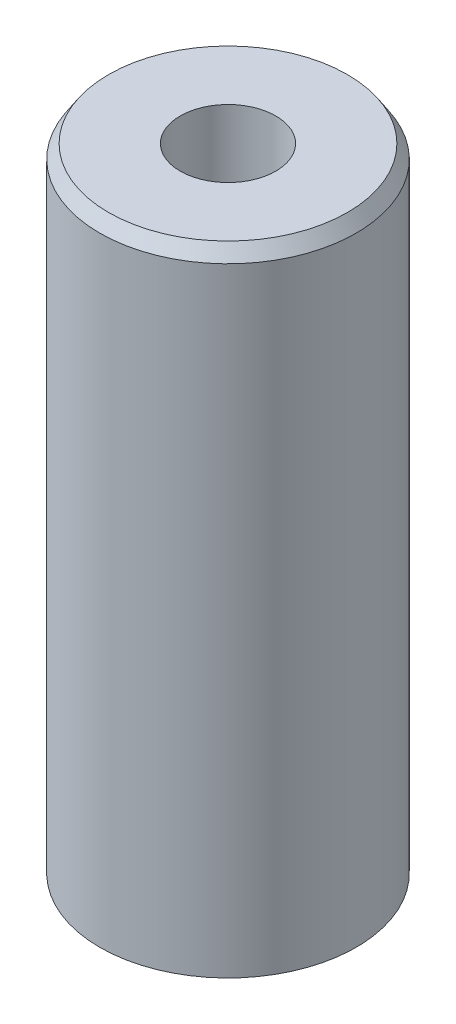
ISO-10303-21;
HEADER;
FILE_DESCRIPTION(('STEP AP214'),'2;1');
FILE_NAME('part.step','',(''),(''),'','','');
FILE_SCHEMA(('AUTOMOTIVE_DESIGN { 1 0 10303 214 1 1 1 1 }'));
ENDSEC;
DATA;
#1=APPLICATION_CONTEXT('core data for automotive mechanical design processes');
#2=APPLICATION_PROTOCOL_DEFINITION('international standard','automotive_design',2000,#1);
#3=PRODUCT_CONTEXT('',#1,'mechanical');
#4=PRODUCT('Part','Part','',(#3));
#5=PRODUCT_RELATED_PRODUCT_CATEGORY('part','',(#4));
#6=PRODUCT_DEFINITION_FORMATION('','',#4);
#7=PRODUCT_DEFINITION_CONTEXT('part definition',#1,'design');
#8=PRODUCT_DEFINITION('design','',#6,#7);
#9=PRODUCT_DEFINITION_SHAPE('','',#8);
#10=(LENGTH_UNIT() NAMED_UNIT(*) SI_UNIT(.MILLI.,.METRE.));
#11=(NAMED_UNIT(*) PLANE_ANGLE_UNIT() SI_UNIT($,.RADIAN.));
#12=(NAMED_UNIT(*) SI_UNIT($,.STERADIAN.) SOLID_ANGLE_UNIT());
#13=UNCERTAINTY_MEASURE_WITH_UNIT(LENGTH_MEASURE(1.E-05),#10,'distance_accuracy_value','');
#14=(GEOMETRIC_REPRESENTATION_CONTEXT(3) GLOBAL_UNCERTAINTY_ASSIGNED_CONTEXT((#13)) GLOBAL_UNIT_ASSIGNED_CONTEXT((#10,
#11,#12)) REPRESENTATION_CONTEXT('',''));
#15=CARTESIAN_POINT('',(0.,0.,0.));
#16=DIRECTION('',(0.,0.,1.));
#17=DIRECTION('',(1.,0.,0.));
#18=AXIS2_PLACEMENT_3D('',#15,#16,#17);
#19=CARTESIAN_POINT('',(0.,49.9819807801235,0.));
#20=DIRECTION('',(0.,-1.,0.));
#21=DIRECTION('',(0.,0.,-1.));
#22=AXIS2_PLACEMENT_3D('',#19,#20,#21);
#23=CYLINDRICAL_SURFACE('',#22,10.);
#24=CARTESIAN_POINT('',(0.,48.9270818391144,0.));
#25=DIRECTION('',(0.,1.,0.));
#26=DIRECTION('',(0.,0.,1.));
#27=AXIS2_PLACEMENT_3D('',#24,#25,#26);
#28=CIRCLE('',#27,10.);
#29=CARTESIAN_POINT('',(0.,48.9270818391144,10.));
#30=VERTEX_POINT('',#29);
#31=EDGE_CURVE('E50',#30,#30,#28,.F.);
#32=ORIENTED_EDGE('',*,*,#31,.T.);
#33=EDGE_LOOP('',(#32));
#34=FACE_BOUND('',#33,.T.);
#35=CARTESIAN_POINT('',(0.,0.68275635539175,0.));
#36=DIRECTION('',(0.,1.,0.));
#37=DIRECTION('',(0.,0.,1.));
#38=AXIS2_PLACEMENT_3D('',#35,#36,#37);
#39=CIRCLE('',#38,10.);
#40=CARTESIAN_POINT('',(0.,0.68275635539175,10.));
#41=VERTEX_POINT('',#40);
#42=EDGE_CURVE('E51',#41,#41,#39,.T.);
#43=ORIENTED_EDGE('',*,*,#42,.T.);
#44=EDGE_LOOP('',(#43));
#45=FACE_BOUND('',#44,.T.);
#46=ADVANCED_FACE('F39',(#34,#45),#23,.T.);
#47=CARTESIAN_POINT('',(0.,49.9819807801235,0.));
#48=DIRECTION('',(0.,1.,0.));
#49=DIRECTION('',(0.,0.,1.));
#50=AXIS2_PLACEMENT_3D('',#47,#48,#49);
#51=PLANE('',#50);
#52=CARTESIAN_POINT('',(0.,49.9819807801235,0.));
#53=DIRECTION('',(0.,1.,0.));
#54=DIRECTION('',(0.,0.,1.));
#55=AXIS2_PLACEMENT_3D('',#52,#53,#54);
#56=CIRCLE('',#55,9.31724364460826);
#57=CARTESIAN_POINT('',(0.,49.9819807801235,9.31724364460826));
#58=VERTEX_POINT('',#57);
#59=EDGE_CURVE('E54',#58,#58,#56,.T.);
#60=ORIENTED_EDGE('',*,*,#59,.T.);
#61=EDGE_LOOP('',(#60));
#62=FACE_BOUND('',#61,.T.);
#63=CARTESIAN_POINT('',(0.,49.9819807801235,0.));
#64=DIRECTION('',(0.,1.,0.));
#65=DIRECTION('',(0.,0.,1.));
#66=AXIS2_PLACEMENT_3D('',#63,#64,#65);
#67=CIRCLE('',#66,3.73097991146228);
#68=CARTESIAN_POINT('',(0.,49.9819807801235,3.73097991146228));
#69=VERTEX_POINT('',#68);
#70=EDGE_CURVE('E58',#69,#69,#67,.T.);
#71=ORIENTED_EDGE('',*,*,#70,.F.);
#72=EDGE_LOOP('',(#71));
#73=FACE_BOUND('',#72,.T.);
#74=ADVANCED_FACE('F69',(#62,#73),#51,.T.);
#75=CARTESIAN_POINT('',(0.,0.,0.));
#76=DIRECTION('',(0.,1.,0.));
#77=DIRECTION('',(0.,0.,1.));
#78=AXIS2_PLACEMENT_3D('',#75,#76,#77);
#79=PLANE('',#78);
#80=CARTESIAN_POINT('',(0.,0.,0.));
#81=DIRECTION('',(0.,1.,0.));
#82=DIRECTION('',(0.,0.,1.));
#83=AXIS2_PLACEMENT_3D('',#80,#81,#82);
#84=CIRCLE('',#83,8.94510105899095);
#85=CARTESIAN_POINT('',(0.,0.,8.94510105899095));
#86=VERTEX_POINT('',#85);
#87=EDGE_CURVE('E10',#86,#86,#84,.F.);
#88=ORIENTED_EDGE('',*,*,#87,.T.);
#89=EDGE_LOOP('',(#88));
#90=FACE_BOUND('',#89,.T.);
#91=CARTESIAN_POINT('',(0.,0.,0.));
#92=DIRECTION('',(0.,1.,0.));
#93=DIRECTION('',(0.,0.,1.));
#94=AXIS2_PLACEMENT_3D('',#91,#92,#93);
#95=CIRCLE('',#94,3.73097991146228);
#96=CARTESIAN_POINT('',(0.,0.,3.73097991146228));
#97=VERTEX_POINT('',#96);
#98=EDGE_CURVE('E63',#97,#97,#95,.T.);
#99=ORIENTED_EDGE('',*,*,#98,.T.);
#100=EDGE_LOOP('',(#99));
#101=FACE_BOUND('',#100,.T.);
#102=ADVANCED_FACE('F75',(#90,#101),#79,.F.);
#103=CARTESIAN_POINT('',(0.,49.9819807801235,0.));
#104=DIRECTION('',(0.,-1.,0.));
#105=DIRECTION('',(0.,0.,-1.));
#106=AXIS2_PLACEMENT_3D('',#103,#104,#105);
#107=CYLINDRICAL_SURFACE('',#106,3.73097991146228);
#108=ORIENTED_EDGE('',*,*,#70,.T.);
#109=EDGE_LOOP('',(#108));
#110=FACE_BOUND('',#109,.T.);
#111=ORIENTED_EDGE('',*,*,#98,.F.);
#112=EDGE_LOOP('',(#111));
#113=FACE_BOUND('',#112,.T.);
#114=ADVANCED_FACE('F70',(#110,#113),#107,.F.);
#115=CARTESIAN_POINT('',(0.,49.9819807801235,0.));
#116=DIRECTION('',(0.,-1.,0.));
#117=DIRECTION('',(0.,0.,-1.));
#118=AXIS2_PLACEMENT_3D('',#115,#116,#117);
#119=CONICAL_SURFACE('',#118,9.31724364460826,0.574421546768426);
#120=ORIENTED_EDGE('',*,*,#31,.F.);
#121=EDGE_LOOP('',(#120));
#122=FACE_BOUND('',#121,.T.);
#123=ORIENTED_EDGE('',*,*,#59,.F.);
#124=EDGE_LOOP('',(#123));
#125=FACE_BOUND('',#124,.T.);
#126=ADVANCED_FACE('F81',(#122,#125),#119,.T.);
#127=CARTESIAN_POINT('',(0.,0.68275635539175,0.));
#128=DIRECTION('',(0.,1.,0.));
#129=DIRECTION('',(0.,0.,1.));
#130=AXIS2_PLACEMENT_3D('',#127,#128,#129);
#131=CONICAL_SURFACE('',#130,10.,0.996374780026467);
#132=ORIENTED_EDGE('',*,*,#87,.F.);
#133=EDGE_LOOP('',(#132));
#134=FACE_BOUND('',#133,.T.);
#135=ORIENTED_EDGE('',*,*,#42,.F.);
#136=EDGE_LOOP('',(#135));
#137=FACE_BOUND('',#136,.T.);
#138=ADVANCED_FACE('F45',(#134,#137),#131,.T.);
#139=CLOSED_SHELL('',(#46,#74,#102,#114,#126,#138));
#140=MANIFOLD_SOLID_BREP('B2',#139);
#141=ADVANCED_BREP_SHAPE_REPRESENTATION('',(#18,#140),#14);
#142=SHAPE_DEFINITION_REPRESENTATION(#9,#141);
ENDSEC;
END-ISO-10303-21;
